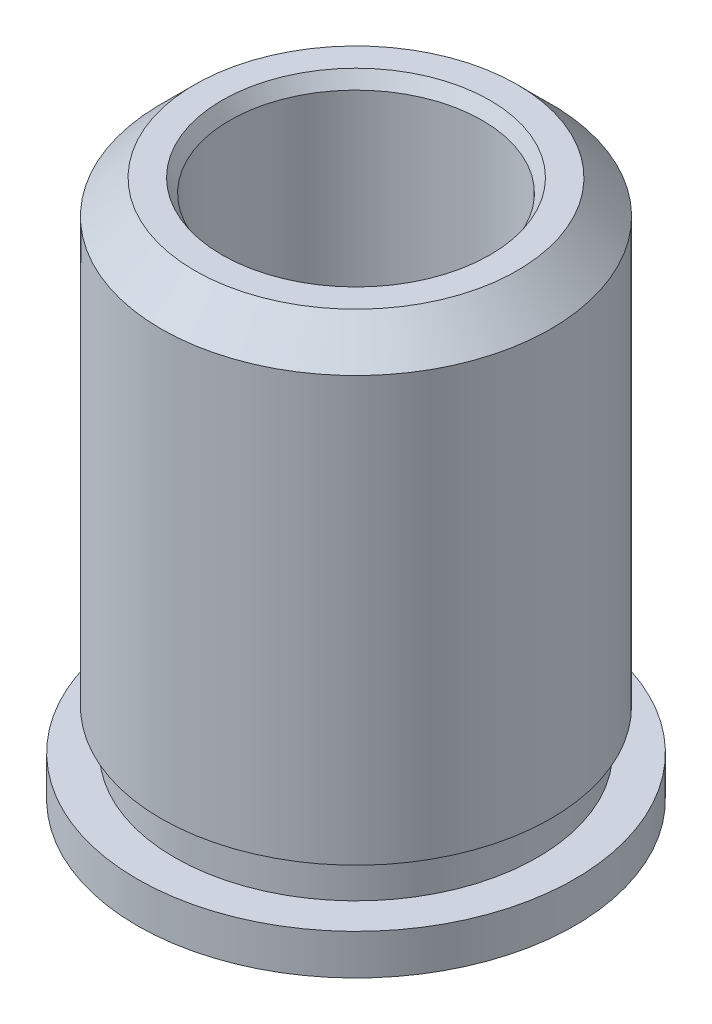
ISO-10303-21;
HEADER;
FILE_DESCRIPTION(('STEP AP214'),'2;1');
FILE_NAME('part.step','',(''),(''),'','','');
FILE_SCHEMA(('AUTOMOTIVE_DESIGN { 1 0 10303 214 1 1 1 1 }'));
ENDSEC;
DATA;
#1=APPLICATION_CONTEXT('core data for automotive mechanical design processes');
#2=APPLICATION_PROTOCOL_DEFINITION('international standard','automotive_design',2000,#1);
#3=PRODUCT_CONTEXT('',#1,'mechanical');
#4=PRODUCT('Part','Part','',(#3));
#5=PRODUCT_RELATED_PRODUCT_CATEGORY('part','',(#4));
#6=PRODUCT_DEFINITION_FORMATION('','',#4);
#7=PRODUCT_DEFINITION_CONTEXT('part definition',#1,'design');
#8=PRODUCT_DEFINITION('design','',#6,#7);
#9=PRODUCT_DEFINITION_SHAPE('','',#8);
#10=(LENGTH_UNIT() NAMED_UNIT(*) SI_UNIT(.MILLI.,.METRE.));
#11=(NAMED_UNIT(*) PLANE_ANGLE_UNIT() SI_UNIT($,.RADIAN.));
#12=(NAMED_UNIT(*) SI_UNIT($,.STERADIAN.) SOLID_ANGLE_UNIT());
#13=UNCERTAINTY_MEASURE_WITH_UNIT(LENGTH_MEASURE(1.E-05),#10,'distance_accuracy_value','');
#14=(GEOMETRIC_REPRESENTATION_CONTEXT(3) GLOBAL_UNCERTAINTY_ASSIGNED_CONTEXT((#13)) GLOBAL_UNIT_ASSIGNED_CONTEXT((#10,
#11,#12)) REPRESENTATION_CONTEXT('',''));
#15=CARTESIAN_POINT('',(0.,0.,0.));
#16=DIRECTION('',(0.,0.,1.));
#17=DIRECTION('',(1.,0.,0.));
#18=AXIS2_PLACEMENT_3D('',#15,#16,#17);
#19=CARTESIAN_POINT('',(0.,5.08,0.));
#20=DIRECTION('',(0.,1.,0.));
#21=DIRECTION('',(0.,0.,1.));
#22=AXIS2_PLACEMENT_3D('',#19,#20,#21);
#23=CYLINDRICAL_SURFACE('',#22,4.1275);
#24=CARTESIAN_POINT('',(0.,-5.08,0.));
#25=DIRECTION('',(0.,1.,0.));
#26=DIRECTION('',(0.,0.,1.));
#27=AXIS2_PLACEMENT_3D('',#24,#25,#26);
#28=CIRCLE('',#27,4.1275);
#29=CARTESIAN_POINT('',(0.,-5.08,4.1275));
#30=VERTEX_POINT('',#29);
#31=EDGE_CURVE('E51',#30,#30,#28,.T.);
#32=ORIENTED_EDGE('',*,*,#31,.T.);
#33=EDGE_LOOP('',(#32));
#34=FACE_BOUND('',#33,.T.);
#35=CARTESIAN_POINT('',(0.,-4.318,0.));
#36=DIRECTION('',(0.,1.,0.));
#37=DIRECTION('',(0.,0.,1.));
#38=AXIS2_PLACEMENT_3D('',#35,#36,#37);
#39=CIRCLE('',#38,4.1275);
#40=CARTESIAN_POINT('',(0.,-4.318,4.1275));
#41=VERTEX_POINT('',#40);
#42=EDGE_CURVE('E9',#41,#41,#39,.T.);
#43=ORIENTED_EDGE('',*,*,#42,.F.);
#44=EDGE_LOOP('',(#43));
#45=FACE_BOUND('',#44,.T.);
#46=ADVANCED_FACE('F14',(#34,#45),#23,.T.);
#47=CARTESIAN_POINT('',(2.06375,-4.318,0.));
#48=DIRECTION('',(0.,1.,0.));
#49=DIRECTION('',(0.,0.,1.));
#50=AXIS2_PLACEMENT_3D('',#47,#48,#49);
#51=PLANE('',#50);
#52=ORIENTED_EDGE('',*,*,#42,.T.);
#53=EDGE_LOOP('',(#52));
#54=FACE_BOUND('',#53,.T.);
#55=CARTESIAN_POINT('',(0.,-4.318,0.));
#56=DIRECTION('',(0.,1.,0.));
#57=DIRECTION('',(0.,0.,1.));
#58=AXIS2_PLACEMENT_3D('',#55,#56,#57);
#59=CIRCLE('',#58,3.42265);
#60=CARTESIAN_POINT('',(0.,-4.318,3.42265));
#61=VERTEX_POINT('',#60);
#62=EDGE_CURVE('E20',#61,#61,#59,.T.);
#63=ORIENTED_EDGE('',*,*,#62,.F.);
#64=EDGE_LOOP('',(#63));
#65=FACE_BOUND('',#64,.T.);
#66=ADVANCED_FACE('F77',(#54,#65),#51,.T.);
#67=CARTESIAN_POINT('',(0.,5.08,0.));
#68=DIRECTION('',(0.,1.,0.));
#69=DIRECTION('',(0.,0.,1.));
#70=AXIS2_PLACEMENT_3D('',#67,#68,#69);
#71=CYLINDRICAL_SURFACE('',#70,3.42265);
#72=ORIENTED_EDGE('',*,*,#62,.T.);
#73=EDGE_LOOP('',(#72));
#74=FACE_BOUND('',#73,.T.);
#75=CARTESIAN_POINT('',(0.,-3.556,0.));
#76=DIRECTION('',(0.,1.,0.));
#77=DIRECTION('',(0.,0.,1.));
#78=AXIS2_PLACEMENT_3D('',#75,#76,#77);
#79=CIRCLE('',#78,3.42265);
#80=CARTESIAN_POINT('',(0.,-3.556,3.42265));
#81=VERTEX_POINT('',#80);
#82=EDGE_CURVE('E24',#81,#81,#79,.T.);
#83=ORIENTED_EDGE('',*,*,#82,.F.);
#84=EDGE_LOOP('',(#83));
#85=FACE_BOUND('',#84,.T.);
#86=ADVANCED_FACE('F82',(#74,#85),#71,.T.);
#87=CARTESIAN_POINT('',(2.06375,-3.556,0.));
#88=DIRECTION('',(0.,-1.,0.));
#89=DIRECTION('',(0.,0.,-1.));
#90=AXIS2_PLACEMENT_3D('',#87,#88,#89);
#91=PLANE('',#90);
#92=ORIENTED_EDGE('',*,*,#82,.T.);
#93=EDGE_LOOP('',(#92));
#94=FACE_BOUND('',#93,.T.);
#95=CARTESIAN_POINT('',(0.,-3.556,0.));
#96=DIRECTION('',(0.,1.,0.));
#97=DIRECTION('',(0.,0.,1.));
#98=AXIS2_PLACEMENT_3D('',#95,#96,#97);
#99=CIRCLE('',#98,3.67665);
#100=CARTESIAN_POINT('',(0.,-3.556,3.67665));
#101=VERTEX_POINT('',#100);
#102=EDGE_CURVE('E28',#101,#101,#99,.T.);
#103=ORIENTED_EDGE('',*,*,#102,.F.);
#104=EDGE_LOOP('',(#103));
#105=FACE_BOUND('',#104,.T.);
#106=ADVANCED_FACE('F87',(#94,#105),#91,.T.);
#107=CARTESIAN_POINT('',(0.,5.08,0.));
#108=DIRECTION('',(0.,1.,0.));
#109=DIRECTION('',(0.,0.,1.));
#110=AXIS2_PLACEMENT_3D('',#107,#108,#109);
#111=CYLINDRICAL_SURFACE('',#110,3.67665);
#112=ORIENTED_EDGE('',*,*,#102,.T.);
#113=EDGE_LOOP('',(#112));
#114=FACE_BOUND('',#113,.T.);
#115=CARTESIAN_POINT('',(0.,4.445,0.));
#116=DIRECTION('',(0.,1.,0.));
#117=DIRECTION('',(0.,0.,1.));
#118=AXIS2_PLACEMENT_3D('',#115,#116,#117);
#119=CIRCLE('',#118,3.67665);
#120=CARTESIAN_POINT('',(0.,4.445,3.67665));
#121=VERTEX_POINT('',#120);
#122=EDGE_CURVE('E33',#121,#121,#119,.T.);
#123=ORIENTED_EDGE('',*,*,#122,.F.);
#124=EDGE_LOOP('',(#123));
#125=FACE_BOUND('',#124,.T.);
#126=ADVANCED_FACE('F93',(#114,#125),#111,.T.);
#127=CARTESIAN_POINT('',(0.,5.08,0.));
#128=DIRECTION('',(0.,-1.,0.));
#129=DIRECTION('',(0.,0.,-1.));
#130=AXIS2_PLACEMENT_3D('',#127,#128,#129);
#131=CONICAL_SURFACE('',#130,3.04165,0.785398163397447);
#132=ORIENTED_EDGE('',*,*,#122,.T.);
#133=EDGE_LOOP('',(#132));
#134=FACE_BOUND('',#133,.T.);
#135=CARTESIAN_POINT('',(0.,5.08,0.));
#136=DIRECTION('',(0.,1.,0.));
#137=DIRECTION('',(0.,0.,1.));
#138=AXIS2_PLACEMENT_3D('',#135,#136,#137);
#139=CIRCLE('',#138,3.04165);
#140=CARTESIAN_POINT('',(0.,5.08,3.04165));
#141=VERTEX_POINT('',#140);
#142=EDGE_CURVE('E36',#141,#141,#139,.T.);
#143=ORIENTED_EDGE('',*,*,#142,.F.);
#144=EDGE_LOOP('',(#143));
#145=FACE_BOUND('',#144,.T.);
#146=ADVANCED_FACE('F97',(#134,#145),#131,.T.);
#147=CARTESIAN_POINT('',(2.06375,5.08,0.));
#148=DIRECTION('',(0.,1.,0.));
#149=DIRECTION('',(0.,0.,1.));
#150=AXIS2_PLACEMENT_3D('',#147,#148,#149);
#151=PLANE('',#150);
#152=ORIENTED_EDGE('',*,*,#142,.T.);
#153=EDGE_LOOP('',(#152));
#154=FACE_BOUND('',#153,.T.);
#155=CARTESIAN_POINT('',(0.,5.08,0.));
#156=DIRECTION('',(0.,1.,0.));
#157=DIRECTION('',(0.,0.,1.));
#158=AXIS2_PLACEMENT_3D('',#155,#156,#157);
#159=CIRCLE('',#158,2.52789696837417);
#160=CARTESIAN_POINT('',(0.,5.08,2.52789696837417));
#161=VERTEX_POINT('',#160);
#162=EDGE_CURVE('E39',#161,#161,#159,.T.);
#163=ORIENTED_EDGE('',*,*,#162,.F.);
#164=EDGE_LOOP('',(#163));
#165=FACE_BOUND('',#164,.T.);
#166=ADVANCED_FACE('F101',(#154,#165),#151,.T.);
#167=CARTESIAN_POINT('',(0.,4.826,0.));
#168=DIRECTION('',(0.,1.,0.));
#169=DIRECTION('',(0.,0.,1.));
#170=AXIS2_PLACEMENT_3D('',#167,#168,#169);
#171=CONICAL_SURFACE('',#170,2.38125,0.523598775598303);
#172=ORIENTED_EDGE('',*,*,#162,.T.);
#173=EDGE_LOOP('',(#172));
#174=FACE_BOUND('',#173,.T.);
#175=CARTESIAN_POINT('',(0.,4.826,0.));
#176=DIRECTION('',(0.,1.,0.));
#177=DIRECTION('',(0.,0.,1.));
#178=AXIS2_PLACEMENT_3D('',#175,#176,#177);
#179=CIRCLE('',#178,2.38125);
#180=CARTESIAN_POINT('',(0.,4.826,2.38125));
#181=VERTEX_POINT('',#180);
#182=EDGE_CURVE('E42',#181,#181,#179,.T.);
#183=ORIENTED_EDGE('',*,*,#182,.F.);
#184=EDGE_LOOP('',(#183));
#185=FACE_BOUND('',#184,.T.);
#186=ADVANCED_FACE('F73',(#174,#185),#171,.F.);
#187=CARTESIAN_POINT('',(0.,5.08,0.));
#188=DIRECTION('',(0.,1.,0.));
#189=DIRECTION('',(0.,0.,1.));
#190=AXIS2_PLACEMENT_3D('',#187,#188,#189);
#191=CYLINDRICAL_SURFACE('',#190,2.38125);
#192=ORIENTED_EDGE('',*,*,#182,.T.);
#193=EDGE_LOOP('',(#192));
#194=FACE_BOUND('',#193,.T.);
#195=CARTESIAN_POINT('',(0.,-4.826,0.));
#196=DIRECTION('',(0.,1.,0.));
#197=DIRECTION('',(0.,0.,1.));
#198=AXIS2_PLACEMENT_3D('',#195,#196,#197);
#199=CIRCLE('',#198,2.38125);
#200=CARTESIAN_POINT('',(0.,-4.826,2.38125));
#201=VERTEX_POINT('',#200);
#202=EDGE_CURVE('E45',#201,#201,#199,.T.);
#203=ORIENTED_EDGE('',*,*,#202,.F.);
#204=EDGE_LOOP('',(#203));
#205=FACE_BOUND('',#204,.T.);
#206=ADVANCED_FACE('F65',(#194,#205),#191,.F.);
#207=CARTESIAN_POINT('',(0.,-5.08,0.));
#208=DIRECTION('',(0.,-1.,0.));
#209=DIRECTION('',(0.,0.,-1.));
#210=AXIS2_PLACEMENT_3D('',#207,#208,#209);
#211=CONICAL_SURFACE('',#210,2.52789696837417,0.523598775598299);
#212=ORIENTED_EDGE('',*,*,#202,.T.);
#213=EDGE_LOOP('',(#212));
#214=FACE_BOUND('',#213,.T.);
#215=CARTESIAN_POINT('',(0.,-5.08,0.));
#216=DIRECTION('',(0.,1.,0.));
#217=DIRECTION('',(0.,0.,1.));
#218=AXIS2_PLACEMENT_3D('',#215,#216,#217);
#219=CIRCLE('',#218,2.52789696837417);
#220=CARTESIAN_POINT('',(0.,-5.08,2.52789696837417));
#221=VERTEX_POINT('',#220);
#222=EDGE_CURVE('E48',#221,#221,#219,.T.);
#223=ORIENTED_EDGE('',*,*,#222,.F.);
#224=EDGE_LOOP('',(#223));
#225=FACE_BOUND('',#224,.T.);
#226=ADVANCED_FACE('F60',(#214,#225),#211,.F.);
#227=CARTESIAN_POINT('',(2.06375,-5.08,0.));
#228=DIRECTION('',(0.,1.,0.));
#229=DIRECTION('',(0.,0.,1.));
#230=AXIS2_PLACEMENT_3D('',#227,#228,#229);
#231=PLANE('',#230);
#232=ORIENTED_EDGE('',*,*,#31,.F.);
#233=EDGE_LOOP('',(#232));
#234=FACE_BOUND('',#233,.T.);
#235=ORIENTED_EDGE('',*,*,#222,.T.);
#236=EDGE_LOOP('',(#235));
#237=FACE_BOUND('',#236,.T.);
#238=ADVANCED_FACE('F57',(#234,#237),#231,.F.);
#239=CLOSED_SHELL('',(#46,#66,#86,#106,#126,#146,#166,#186,#206,#226,#238));
#240=MANIFOLD_SOLID_BREP('B1',#239);
#241=ADVANCED_BREP_SHAPE_REPRESENTATION('',(#18,#240),#14);
#242=SHAPE_DEFINITION_REPRESENTATION(#9,#241);
ENDSEC;
END-ISO-10303-21;
